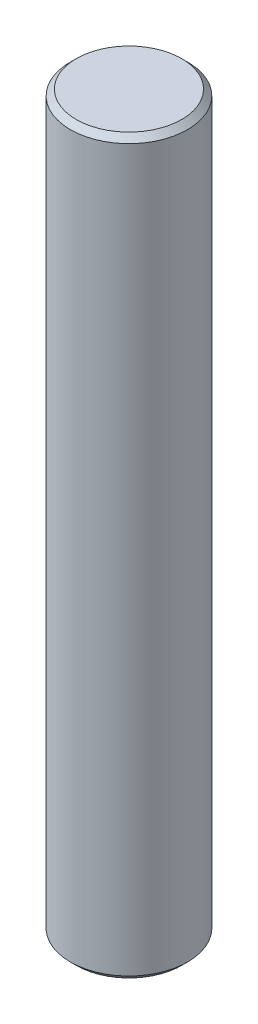
ISO-10303-21;
HEADER;
FILE_DESCRIPTION(('STEP AP214'),'2;1');
FILE_NAME('part.step','',(''),(''),'','','');
FILE_SCHEMA(('AUTOMOTIVE_DESIGN { 1 0 10303 214 1 1 1 1 }'));
ENDSEC;
DATA;
#1=APPLICATION_CONTEXT('core data for automotive mechanical design processes');
#2=APPLICATION_PROTOCOL_DEFINITION('international standard','automotive_design',2000,#1);
#3=PRODUCT_CONTEXT('',#1,'mechanical');
#4=PRODUCT('Part','Part','',(#3));
#5=PRODUCT_RELATED_PRODUCT_CATEGORY('part','',(#4));
#6=PRODUCT_DEFINITION_FORMATION('','',#4);
#7=PRODUCT_DEFINITION_CONTEXT('part definition',#1,'design');
#8=PRODUCT_DEFINITION('design','',#6,#7);
#9=PRODUCT_DEFINITION_SHAPE('','',#8);
#10=(LENGTH_UNIT() NAMED_UNIT(*) SI_UNIT(.MILLI.,.METRE.));
#11=(NAMED_UNIT(*) PLANE_ANGLE_UNIT() SI_UNIT($,.RADIAN.));
#12=(NAMED_UNIT(*) SI_UNIT($,.STERADIAN.) SOLID_ANGLE_UNIT());
#13=UNCERTAINTY_MEASURE_WITH_UNIT(LENGTH_MEASURE(1.E-05),#10,'distance_accuracy_value','');
#14=(GEOMETRIC_REPRESENTATION_CONTEXT(3) GLOBAL_UNCERTAINTY_ASSIGNED_CONTEXT((#13)) GLOBAL_UNIT_ASSIGNED_CONTEXT((#10,
#11,#12)) REPRESENTATION_CONTEXT('',''));
#15=CARTESIAN_POINT('',(0.,0.,0.));
#16=DIRECTION('',(0.,0.,1.));
#17=DIRECTION('',(1.,0.,0.));
#18=AXIS2_PLACEMENT_3D('',#15,#16,#17);
#19=CARTESIAN_POINT('',(0.,25.,0.));
#20=DIRECTION('',(0.,-1.,0.));
#21=DIRECTION('',(0.,0.,-1.));
#22=AXIS2_PLACEMENT_3D('',#19,#20,#21);
#23=CYLINDRICAL_SURFACE('',#22,2.);
#24=CARTESIAN_POINT('',(0.,24.8,0.));
#25=DIRECTION('',(0.,1.,0.));
#26=DIRECTION('',(0.,0.,1.));
#27=AXIS2_PLACEMENT_3D('',#24,#25,#26);
#28=CIRCLE('',#27,2.);
#29=CARTESIAN_POINT('',(0.,24.8,2.));
#30=VERTEX_POINT('',#29);
#31=EDGE_CURVE('E45',#30,#30,#28,.F.);
#32=ORIENTED_EDGE('',*,*,#31,.T.);
#33=EDGE_LOOP('',(#32));
#34=FACE_BOUND('',#33,.T.);
#35=CARTESIAN_POINT('',(0.,0.199999999999999,0.));
#36=DIRECTION('',(0.,1.,0.));
#37=DIRECTION('',(0.,0.,1.));
#38=AXIS2_PLACEMENT_3D('',#35,#36,#37);
#39=CIRCLE('',#38,2.);
#40=CARTESIAN_POINT('',(0.,0.199999999999999,2.));
#41=VERTEX_POINT('',#40);
#42=EDGE_CURVE('E49',#41,#41,#39,.T.);
#43=ORIENTED_EDGE('',*,*,#42,.T.);
#44=EDGE_LOOP('',(#43));
#45=FACE_BOUND('',#44,.T.);
#46=ADVANCED_FACE('F37',(#34,#45),#23,.T.);
#47=CARTESIAN_POINT('',(0.,25.,0.));
#48=DIRECTION('',(0.,1.,0.));
#49=DIRECTION('',(0.,0.,1.));
#50=AXIS2_PLACEMENT_3D('',#47,#48,#49);
#51=PLANE('',#50);
#52=CARTESIAN_POINT('',(0.,25.,0.));
#53=DIRECTION('',(0.,1.,0.));
#54=DIRECTION('',(0.,0.,1.));
#55=AXIS2_PLACEMENT_3D('',#52,#53,#54);
#56=CIRCLE('',#55,1.8);
#57=CARTESIAN_POINT('',(0.,25.,1.8));
#58=VERTEX_POINT('',#57);
#59=EDGE_CURVE('E53',#58,#58,#56,.T.);
#60=ORIENTED_EDGE('',*,*,#59,.T.);
#61=EDGE_LOOP('',(#60));
#62=FACE_BOUND('',#61,.T.);
#63=ADVANCED_FACE('F59',(#62),#51,.T.);
#64=CARTESIAN_POINT('',(0.,0.,0.));
#65=DIRECTION('',(0.,1.,0.));
#66=DIRECTION('',(0.,0.,1.));
#67=AXIS2_PLACEMENT_3D('',#64,#65,#66);
#68=PLANE('',#67);
#69=CARTESIAN_POINT('',(0.,0.,0.));
#70=DIRECTION('',(0.,1.,0.));
#71=DIRECTION('',(0.,0.,1.));
#72=AXIS2_PLACEMENT_3D('',#69,#70,#71);
#73=CIRCLE('',#72,1.8);
#74=CARTESIAN_POINT('',(0.,0.,1.8));
#75=VERTEX_POINT('',#74);
#76=EDGE_CURVE('E10',#75,#75,#73,.F.);
#77=ORIENTED_EDGE('',*,*,#76,.T.);
#78=EDGE_LOOP('',(#77));
#79=FACE_BOUND('',#78,.T.);
#80=ADVANCED_FACE('F63',(#79),#68,.F.);
#81=CARTESIAN_POINT('',(0.,25.,0.));
#82=DIRECTION('',(0.,-1.,0.));
#83=DIRECTION('',(0.,0.,-1.));
#84=AXIS2_PLACEMENT_3D('',#81,#82,#83);
#85=CONICAL_SURFACE('',#84,1.8,0.785398163397453);
#86=ORIENTED_EDGE('',*,*,#31,.F.);
#87=EDGE_LOOP('',(#86));
#88=FACE_BOUND('',#87,.T.);
#89=ORIENTED_EDGE('',*,*,#59,.F.);
#90=EDGE_LOOP('',(#89));
#91=FACE_BOUND('',#90,.T.);
#92=ADVANCED_FACE('F61',(#88,#91),#85,.T.);
#93=CARTESIAN_POINT('',(0.,0.199999999999999,0.));
#94=DIRECTION('',(0.,1.,0.));
#95=DIRECTION('',(0.,0.,1.));
#96=AXIS2_PLACEMENT_3D('',#93,#94,#95);
#97=CONICAL_SURFACE('',#96,2.,0.785398163397444);
#98=ORIENTED_EDGE('',*,*,#76,.F.);
#99=EDGE_LOOP('',(#98));
#100=FACE_BOUND('',#99,.T.);
#101=ORIENTED_EDGE('',*,*,#42,.F.);
#102=EDGE_LOOP('',(#101));
#103=FACE_BOUND('',#102,.T.);
#104=ADVANCED_FACE('F40',(#100,#103),#97,.T.);
#105=CLOSED_SHELL('',(#46,#63,#80,#92,#104));
#106=MANIFOLD_SOLID_BREP('B2',#105);
#107=ADVANCED_BREP_SHAPE_REPRESENTATION('',(#18,#106),#14);
#108=SHAPE_DEFINITION_REPRESENTATION(#9,#107);
ENDSEC;
END-ISO-10303-21;
